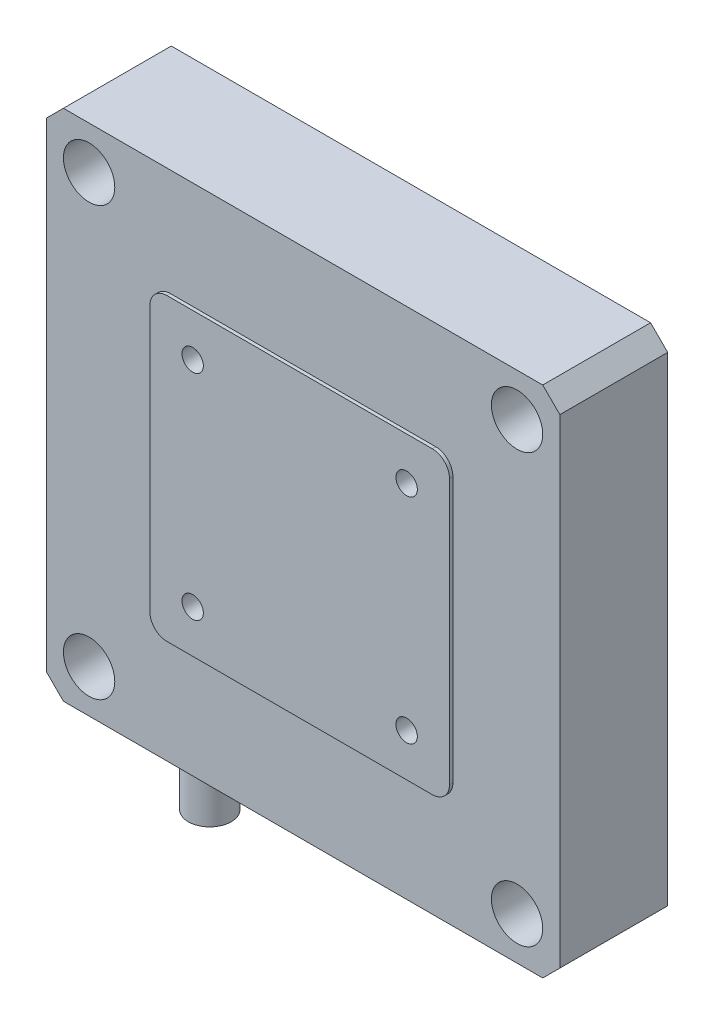
ISO-10303-21;
HEADER;
FILE_DESCRIPTION(('STEP AP214'),'2;1');
FILE_NAME('part.step','',(''),(''),'','','');
FILE_SCHEMA(('AUTOMOTIVE_DESIGN { 1 0 10303 214 1 1 1 1 }'));
ENDSEC;
DATA;
#1=APPLICATION_CONTEXT('core data for automotive mechanical design processes');
#2=APPLICATION_PROTOCOL_DEFINITION('international standard','automotive_design',2000,#1);
#3=PRODUCT_CONTEXT('',#1,'mechanical');
#4=PRODUCT('Part','Part','',(#3));
#5=PRODUCT_RELATED_PRODUCT_CATEGORY('part','',(#4));
#6=PRODUCT_DEFINITION_FORMATION('','',#4);
#7=PRODUCT_DEFINITION_CONTEXT('part definition',#1,'design');
#8=PRODUCT_DEFINITION('design','',#6,#7);
#9=PRODUCT_DEFINITION_SHAPE('','',#8);
#10=(LENGTH_UNIT() NAMED_UNIT(*) SI_UNIT(.MILLI.,.METRE.));
#11=(NAMED_UNIT(*) PLANE_ANGLE_UNIT() SI_UNIT($,.RADIAN.));
#12=(NAMED_UNIT(*) SI_UNIT($,.STERADIAN.) SOLID_ANGLE_UNIT());
#13=UNCERTAINTY_MEASURE_WITH_UNIT(LENGTH_MEASURE(1.E-05),#10,'distance_accuracy_value','');
#14=(GEOMETRIC_REPRESENTATION_CONTEXT(3) GLOBAL_UNCERTAINTY_ASSIGNED_CONTEXT((#13)) GLOBAL_UNIT_ASSIGNED_CONTEXT((#10,
#11,#12)) REPRESENTATION_CONTEXT('',''));
#15=CARTESIAN_POINT('',(0.,0.,0.));
#16=DIRECTION('',(0.,0.,1.));
#17=DIRECTION('',(1.,0.,0.));
#18=AXIS2_PLACEMENT_3D('',#15,#16,#17);
#19=CARTESIAN_POINT('',(30.,30.,12.6));
#20=DIRECTION('',(-1.,0.,0.));
#21=DIRECTION('',(0.,-1.,0.));
#22=AXIS2_PLACEMENT_3D('',#19,#20,#21);
#23=PLANE('',#22);
#24=DIRECTION('',(0.,1.,0.));
#25=VECTOR('',#24,1.);
#26=CARTESIAN_POINT('',(30.,30.,12.6));
#27=LINE('',#26,#25);
#28=CARTESIAN_POINT('',(30.,-28.,12.6));
#29=VERTEX_POINT('',#28);
#30=CARTESIAN_POINT('',(30.,28.,12.6));
#31=VERTEX_POINT('',#30);
#32=EDGE_CURVE('E305',#29,#31,#27,.T.);
#33=ORIENTED_EDGE('',*,*,#32,.F.);
#34=DIRECTION('',(0.,0.,-1.));
#35=VECTOR('',#34,1.);
#36=CARTESIAN_POINT('',(30.,-28.,12.6));
#37=LINE('',#36,#35);
#38=CARTESIAN_POINT('',(30.,-28.,0.));
#39=VERTEX_POINT('',#38);
#40=EDGE_CURVE('E377',#29,#39,#37,.T.);
#41=ORIENTED_EDGE('',*,*,#40,.T.);
#42=DIRECTION('',(0.,1.,0.));
#43=VECTOR('',#42,1.);
#44=CARTESIAN_POINT('',(30.,30.,0.));
#45=LINE('',#44,#43);
#46=CARTESIAN_POINT('',(30.,28.,0.));
#47=VERTEX_POINT('',#46);
#48=EDGE_CURVE('E291',#39,#47,#45,.T.);
#49=ORIENTED_EDGE('',*,*,#48,.T.);
#50=DIRECTION('',(0.,0.,1.));
#51=VECTOR('',#50,1.);
#52=CARTESIAN_POINT('',(30.,28.,12.6));
#53=LINE('',#52,#51);
#54=EDGE_CURVE('E374',#47,#31,#53,.T.);
#55=ORIENTED_EDGE('',*,*,#54,.T.);
#56=EDGE_LOOP('',(#33,#41,#49,#55));
#57=FACE_BOUND('',#56,.T.);
#58=ADVANCED_FACE('F41',(#57),#23,.F.);
#59=CARTESIAN_POINT('',(-30.,30.,12.6));
#60=DIRECTION('',(0.,-1.,0.));
#61=DIRECTION('',(0.,0.,-1.));
#62=AXIS2_PLACEMENT_3D('',#59,#60,#61);
#63=PLANE('',#62);
#64=DIRECTION('',(-1.,0.,0.));
#65=VECTOR('',#64,1.);
#66=CARTESIAN_POINT('',(-30.,30.,12.6));
#67=LINE('',#66,#65);
#68=CARTESIAN_POINT('',(28.,30.,12.6));
#69=VERTEX_POINT('',#68);
#70=CARTESIAN_POINT('',(-28.,30.,12.6));
#71=VERTEX_POINT('',#70);
#72=EDGE_CURVE('E309',#69,#71,#67,.T.);
#73=ORIENTED_EDGE('',*,*,#72,.F.);
#74=DIRECTION('',(0.,0.,-1.));
#75=VECTOR('',#74,1.);
#76=CARTESIAN_POINT('',(28.,30.,12.6));
#77=LINE('',#76,#75);
#78=CARTESIAN_POINT('',(28.,30.,0.));
#79=VERTEX_POINT('',#78);
#80=EDGE_CURVE('E384',#69,#79,#77,.T.);
#81=ORIENTED_EDGE('',*,*,#80,.T.);
#82=DIRECTION('',(-1.,0.,0.));
#83=VECTOR('',#82,1.);
#84=CARTESIAN_POINT('',(-30.,30.,0.));
#85=LINE('',#84,#83);
#86=CARTESIAN_POINT('',(-28.,30.,0.));
#87=VERTEX_POINT('',#86);
#88=EDGE_CURVE('E326',#79,#87,#85,.T.);
#89=ORIENTED_EDGE('',*,*,#88,.T.);
#90=DIRECTION('',(0.,0.,1.));
#91=VECTOR('',#90,1.);
#92=CARTESIAN_POINT('',(-28.,30.,12.6));
#93=LINE('',#92,#91);
#94=EDGE_CURVE('E381',#87,#71,#93,.T.);
#95=ORIENTED_EDGE('',*,*,#94,.T.);
#96=EDGE_LOOP('',(#73,#81,#89,#95));
#97=FACE_BOUND('',#96,.T.);
#98=ADVANCED_FACE('F480',(#97),#63,.F.);
#99=CARTESIAN_POINT('',(-30.,30.,12.6));
#100=DIRECTION('',(1.,0.,0.));
#101=DIRECTION('',(0.,1.,0.));
#102=AXIS2_PLACEMENT_3D('',#99,#100,#101);
#103=PLANE('',#102);
#104=DIRECTION('',(0.,-1.,0.));
#105=VECTOR('',#104,1.);
#106=CARTESIAN_POINT('',(-30.,30.,0.));
#107=LINE('',#106,#105);
#108=CARTESIAN_POINT('',(-30.,28.,0.));
#109=VERTEX_POINT('',#108);
#110=CARTESIAN_POINT('',(-30.,-28.,0.));
#111=VERTEX_POINT('',#110);
#112=EDGE_CURVE('E330',#109,#111,#107,.T.);
#113=ORIENTED_EDGE('',*,*,#112,.T.);
#114=DIRECTION('',(0.,0.,1.));
#115=VECTOR('',#114,1.);
#116=CARTESIAN_POINT('',(-30.,-28.,12.6));
#117=LINE('',#116,#115);
#118=CARTESIAN_POINT('',(-30.,-28.,12.6));
#119=VERTEX_POINT('',#118);
#120=EDGE_CURVE('E359',#111,#119,#117,.T.);
#121=ORIENTED_EDGE('',*,*,#120,.T.);
#122=DIRECTION('',(0.,-1.,0.));
#123=VECTOR('',#122,1.);
#124=CARTESIAN_POINT('',(-30.,30.,12.6));
#125=LINE('',#124,#123);
#126=CARTESIAN_POINT('',(-30.,28.,12.6));
#127=VERTEX_POINT('',#126);
#128=EDGE_CURVE('E314',#127,#119,#125,.T.);
#129=ORIENTED_EDGE('',*,*,#128,.F.);
#130=DIRECTION('',(0.,0.,-1.));
#131=VECTOR('',#130,1.);
#132=CARTESIAN_POINT('',(-30.,28.,12.6));
#133=LINE('',#132,#131);
#134=EDGE_CURVE('E355',#127,#109,#133,.T.);
#135=ORIENTED_EDGE('',*,*,#134,.T.);
#136=EDGE_LOOP('',(#113,#121,#129,#135));
#137=FACE_BOUND('',#136,.T.);
#138=ADVANCED_FACE('F486',(#137),#103,.F.);
#139=CARTESIAN_POINT('',(-30.,-30.,12.6));
#140=DIRECTION('',(0.,1.,0.));
#141=DIRECTION('',(0.,0.,1.));
#142=AXIS2_PLACEMENT_3D('',#139,#140,#141);
#143=PLANE('',#142);
#144=CARTESIAN_POINT('',(-18.5,-30.,5.));
#145=DIRECTION('',(0.,1.,0.));
#146=DIRECTION('',(0.,0.,1.));
#147=AXIS2_PLACEMENT_3D('',#144,#145,#146);
#148=CIRCLE('',#147,2.5);
#149=CARTESIAN_POINT('',(-18.5,-30.,7.5));
#150=VERTEX_POINT('',#149);
#151=EDGE_CURVE('E11',#150,#150,#148,.F.);
#152=ORIENTED_EDGE('',*,*,#151,.F.);
#153=EDGE_LOOP('',(#152));
#154=FACE_BOUND('',#153,.T.);
#155=DIRECTION('',(1.,0.,0.));
#156=VECTOR('',#155,1.);
#157=CARTESIAN_POINT('',(-30.,-30.,12.6));
#158=LINE('',#157,#156);
#159=CARTESIAN_POINT('',(-28.,-30.,12.6));
#160=VERTEX_POINT('',#159);
#161=CARTESIAN_POINT('',(28.,-30.,12.6));
#162=VERTEX_POINT('',#161);
#163=EDGE_CURVE('E318',#160,#162,#158,.T.);
#164=ORIENTED_EDGE('',*,*,#163,.F.);
#165=DIRECTION('',(0.,0.,-1.));
#166=VECTOR('',#165,1.);
#167=CARTESIAN_POINT('',(-28.,-30.,12.6));
#168=LINE('',#167,#166);
#169=CARTESIAN_POINT('',(-28.,-30.,0.));
#170=VERTEX_POINT('',#169);
#171=EDGE_CURVE('E339',#160,#170,#168,.T.);
#172=ORIENTED_EDGE('',*,*,#171,.T.);
#173=DIRECTION('',(1.,0.,0.));
#174=VECTOR('',#173,1.);
#175=CARTESIAN_POINT('',(-30.,-30.,0.));
#176=LINE('',#175,#174);
#177=CARTESIAN_POINT('',(28.,-30.,0.));
#178=VERTEX_POINT('',#177);
#179=EDGE_CURVE('E310',#170,#178,#176,.T.);
#180=ORIENTED_EDGE('',*,*,#179,.T.);
#181=DIRECTION('',(0.,0.,1.));
#182=VECTOR('',#181,1.);
#183=CARTESIAN_POINT('',(28.,-30.,12.6));
#184=LINE('',#183,#182);
#185=EDGE_CURVE('E322',#178,#162,#184,.T.);
#186=ORIENTED_EDGE('',*,*,#185,.T.);
#187=EDGE_LOOP('',(#164,#172,#180,#186));
#188=FACE_BOUND('',#187,.T.);
#189=ADVANCED_FACE('F524',(#154,#188),#143,.F.);
#190=CARTESIAN_POINT('',(0.,0.,12.6));
#191=DIRECTION('',(0.,0.,1.));
#192=DIRECTION('',(1.,0.,0.));
#193=AXIS2_PLACEMENT_3D('',#190,#191,#192);
#194=PLANE('',#193);
#195=CARTESIAN_POINT('',(-25.,25.,12.6));
#196=DIRECTION('',(0.,0.,1.));
#197=DIRECTION('',(1.,0.,0.));
#198=AXIS2_PLACEMENT_3D('',#195,#196,#197);
#199=CIRCLE('',#198,3.00000000000001);
#200=CARTESIAN_POINT('',(-22.,25.,12.6));
#201=VERTEX_POINT('',#200);
#202=EDGE_CURVE('E209',#201,#201,#199,.T.);
#203=ORIENTED_EDGE('',*,*,#202,.F.);
#204=EDGE_LOOP('',(#203));
#205=FACE_BOUND('',#204,.T.);
#206=CARTESIAN_POINT('',(25.,25.,12.6));
#207=DIRECTION('',(0.,0.,1.));
#208=DIRECTION('',(1.,0.,0.));
#209=AXIS2_PLACEMENT_3D('',#206,#207,#208);
#210=CIRCLE('',#209,3.00000000000001);
#211=CARTESIAN_POINT('',(28.,25.,12.6));
#212=VERTEX_POINT('',#211);
#213=EDGE_CURVE('E225',#212,#212,#210,.T.);
#214=ORIENTED_EDGE('',*,*,#213,.F.);
#215=EDGE_LOOP('',(#214));
#216=FACE_BOUND('',#215,.T.);
#217=CARTESIAN_POINT('',(-25.,-25.,12.6));
#218=DIRECTION('',(0.,0.,1.));
#219=DIRECTION('',(1.,0.,0.));
#220=AXIS2_PLACEMENT_3D('',#217,#218,#219);
#221=CIRCLE('',#220,3.00000000000001);
#222=CARTESIAN_POINT('',(-22.,-25.,12.6));
#223=VERTEX_POINT('',#222);
#224=EDGE_CURVE('E241',#223,#223,#221,.T.);
#225=ORIENTED_EDGE('',*,*,#224,.F.);
#226=EDGE_LOOP('',(#225));
#227=FACE_BOUND('',#226,.T.);
#228=CARTESIAN_POINT('',(25.,-25.,12.6));
#229=DIRECTION('',(0.,0.,1.));
#230=DIRECTION('',(1.,0.,0.));
#231=AXIS2_PLACEMENT_3D('',#228,#229,#230);
#232=CIRCLE('',#231,3.00000000000001);
#233=CARTESIAN_POINT('',(28.,-25.,12.6));
#234=VERTEX_POINT('',#233);
#235=EDGE_CURVE('E257',#234,#234,#232,.T.);
#236=ORIENTED_EDGE('',*,*,#235,.F.);
#237=EDGE_LOOP('',(#236));
#238=FACE_BOUND('',#237,.T.);
#239=DIRECTION('',(0.,1.,0.));
#240=VECTOR('',#239,1.);
#241=CARTESIAN_POINT('',(17.5,17.5,12.6));
#242=LINE('',#241,#240);
#243=CARTESIAN_POINT('',(17.5,-15.5,12.6));
#244=VERTEX_POINT('',#243);
#245=CARTESIAN_POINT('',(17.5,15.5,12.6));
#246=VERTEX_POINT('',#245);
#247=EDGE_CURVE('E273',#244,#246,#242,.T.);
#248=ORIENTED_EDGE('',*,*,#247,.F.);
#249=CARTESIAN_POINT('',(15.5,-15.5,12.6));
#250=DIRECTION('',(0.,0.,1.));
#251=DIRECTION('',(1.,0.,0.));
#252=AXIS2_PLACEMENT_3D('',#249,#250,#251);
#253=CIRCLE('',#252,2.);
#254=CARTESIAN_POINT('',(15.5,-17.5,12.6));
#255=VERTEX_POINT('',#254);
#256=EDGE_CURVE('E427',#244,#255,#253,.F.);
#257=ORIENTED_EDGE('',*,*,#256,.T.);
#258=DIRECTION('',(1.,0.,0.));
#259=VECTOR('',#258,1.);
#260=CARTESIAN_POINT('',(-17.5,-17.5,12.6));
#261=LINE('',#260,#259);
#262=CARTESIAN_POINT('',(-15.5,-17.5,12.6));
#263=VERTEX_POINT('',#262);
#264=EDGE_CURVE('E279',#263,#255,#261,.T.);
#265=ORIENTED_EDGE('',*,*,#264,.F.);
#266=CARTESIAN_POINT('',(-15.5,-15.5,12.6));
#267=DIRECTION('',(0.,0.,1.));
#268=DIRECTION('',(1.,0.,0.));
#269=AXIS2_PLACEMENT_3D('',#266,#267,#268);
#270=CIRCLE('',#269,2.);
#271=CARTESIAN_POINT('',(-17.5,-15.5,12.6));
#272=VERTEX_POINT('',#271);
#273=EDGE_CURVE('E430',#263,#272,#270,.F.);
#274=ORIENTED_EDGE('',*,*,#273,.T.);
#275=DIRECTION('',(0.,-1.,0.));
#276=VECTOR('',#275,1.);
#277=CARTESIAN_POINT('',(-17.5,17.5,12.6));
#278=LINE('',#277,#276);
#279=CARTESIAN_POINT('',(-17.5,15.5,12.6));
#280=VERTEX_POINT('',#279);
#281=EDGE_CURVE('E298',#280,#272,#278,.T.);
#282=ORIENTED_EDGE('',*,*,#281,.F.);
#283=CARTESIAN_POINT('',(-15.5,15.5,12.6));
#284=DIRECTION('',(0.,0.,1.));
#285=DIRECTION('',(1.,0.,0.));
#286=AXIS2_PLACEMENT_3D('',#283,#284,#285);
#287=CIRCLE('',#286,2.);
#288=CARTESIAN_POINT('',(-15.5,17.5,12.6));
#289=VERTEX_POINT('',#288);
#290=EDGE_CURVE('E50',#280,#289,#287,.F.);
#291=ORIENTED_EDGE('',*,*,#290,.T.);
#292=DIRECTION('',(-1.,0.,0.));
#293=VECTOR('',#292,1.);
#294=CARTESIAN_POINT('',(-17.5,17.5,12.6));
#295=LINE('',#294,#293);
#296=CARTESIAN_POINT('',(15.5,17.5,12.6));
#297=VERTEX_POINT('',#296);
#298=EDGE_CURVE('E295',#297,#289,#295,.T.);
#299=ORIENTED_EDGE('',*,*,#298,.F.);
#300=CARTESIAN_POINT('',(15.5,15.5,12.6));
#301=DIRECTION('',(0.,0.,1.));
#302=DIRECTION('',(1.,0.,0.));
#303=AXIS2_PLACEMENT_3D('',#300,#301,#302);
#304=CIRCLE('',#303,2.);
#305=EDGE_CURVE('E64',#297,#246,#304,.F.);
#306=ORIENTED_EDGE('',*,*,#305,.T.);
#307=EDGE_LOOP('',(#248,#257,#265,#274,#282,#291,#299,#306));
#308=FACE_BOUND('',#307,.T.);
#309=ORIENTED_EDGE('',*,*,#128,.T.);
#310=DIRECTION('',(-0.707106781186548,0.707106781186548,0.));
#311=VECTOR('',#310,1.);
#312=CARTESIAN_POINT('',(-29.,-29.,12.6));
#313=LINE('',#312,#311);
#314=EDGE_CURVE('E371',#119,#160,#313,.F.);
#315=ORIENTED_EDGE('',*,*,#314,.T.);
#316=ORIENTED_EDGE('',*,*,#163,.T.);
#317=DIRECTION('',(-0.707106781186548,-0.707106781186547,0.));
#318=VECTOR('',#317,1.);
#319=CARTESIAN_POINT('',(29.,-29.,12.6));
#320=LINE('',#319,#318);
#321=EDGE_CURVE('E368',#162,#29,#320,.F.);
#322=ORIENTED_EDGE('',*,*,#321,.T.);
#323=ORIENTED_EDGE('',*,*,#32,.T.);
#324=DIRECTION('',(0.707106781186548,-0.707106781186548,0.));
#325=VECTOR('',#324,1.);
#326=CARTESIAN_POINT('',(29.,29.,12.6));
#327=LINE('',#326,#325);
#328=EDGE_CURVE('E365',#31,#69,#327,.F.);
#329=ORIENTED_EDGE('',*,*,#328,.T.);
#330=ORIENTED_EDGE('',*,*,#72,.T.);
#331=DIRECTION('',(0.707106781186548,0.707106781186548,0.));
#332=VECTOR('',#331,1.);
#333=CARTESIAN_POINT('',(-29.,29.,12.6));
#334=LINE('',#333,#332);
#335=EDGE_CURVE('E362',#71,#127,#334,.F.);
#336=ORIENTED_EDGE('',*,*,#335,.T.);
#337=EDGE_LOOP('',(#309,#315,#316,#322,#323,#329,#330,#336));
#338=FACE_BOUND('',#337,.T.);
#339=ADVANCED_FACE('F436',(#205,#216,#227,#238,#308,#338),#194,.T.);
#340=CARTESIAN_POINT('',(0.,0.,0.));
#341=DIRECTION('',(0.,0.,1.));
#342=DIRECTION('',(1.,0.,0.));
#343=AXIS2_PLACEMENT_3D('',#340,#341,#342);
#344=PLANE('',#343);
#345=CARTESIAN_POINT('',(-25.,25.,0.));
#346=DIRECTION('',(0.,0.,1.));
#347=DIRECTION('',(1.,0.,0.));
#348=AXIS2_PLACEMENT_3D('',#345,#346,#347);
#349=CIRCLE('',#348,1.70000000000001);
#350=CARTESIAN_POINT('',(-23.3,25.,0.));
#351=VERTEX_POINT('',#350);
#352=EDGE_CURVE('E221',#351,#351,#349,.T.);
#353=ORIENTED_EDGE('',*,*,#352,.T.);
#354=EDGE_LOOP('',(#353));
#355=FACE_BOUND('',#354,.T.);
#356=CARTESIAN_POINT('',(25.,25.,0.));
#357=DIRECTION('',(0.,0.,1.));
#358=DIRECTION('',(1.,0.,0.));
#359=AXIS2_PLACEMENT_3D('',#356,#357,#358);
#360=CIRCLE('',#359,1.70000000000001);
#361=CARTESIAN_POINT('',(26.7,25.,0.));
#362=VERTEX_POINT('',#361);
#363=EDGE_CURVE('E237',#362,#362,#360,.T.);
#364=ORIENTED_EDGE('',*,*,#363,.T.);
#365=EDGE_LOOP('',(#364));
#366=FACE_BOUND('',#365,.T.);
#367=CARTESIAN_POINT('',(-25.,-25.,0.));
#368=DIRECTION('',(0.,0.,1.));
#369=DIRECTION('',(1.,0.,0.));
#370=AXIS2_PLACEMENT_3D('',#367,#368,#369);
#371=CIRCLE('',#370,1.70000000000001);
#372=CARTESIAN_POINT('',(-23.3,-25.,0.));
#373=VERTEX_POINT('',#372);
#374=EDGE_CURVE('E253',#373,#373,#371,.T.);
#375=ORIENTED_EDGE('',*,*,#374,.T.);
#376=EDGE_LOOP('',(#375));
#377=FACE_BOUND('',#376,.T.);
#378=CARTESIAN_POINT('',(25.,-25.,0.));
#379=DIRECTION('',(0.,0.,1.));
#380=DIRECTION('',(1.,0.,0.));
#381=AXIS2_PLACEMENT_3D('',#378,#379,#380);
#382=CIRCLE('',#381,1.70000000000001);
#383=CARTESIAN_POINT('',(26.7,-25.,0.));
#384=VERTEX_POINT('',#383);
#385=EDGE_CURVE('E269',#384,#384,#382,.T.);
#386=ORIENTED_EDGE('',*,*,#385,.T.);
#387=EDGE_LOOP('',(#386));
#388=FACE_BOUND('',#387,.T.);
#389=ORIENTED_EDGE('',*,*,#179,.F.);
#390=DIRECTION('',(0.707106781186548,-0.707106781186548,0.));
#391=VECTOR('',#390,1.);
#392=CARTESIAN_POINT('',(-28.,-30.,0.));
#393=LINE('',#392,#391);
#394=EDGE_CURVE('E352',#170,#111,#393,.F.);
#395=ORIENTED_EDGE('',*,*,#394,.T.);
#396=ORIENTED_EDGE('',*,*,#112,.F.);
#397=DIRECTION('',(-0.707106781186548,-0.707106781186548,0.));
#398=VECTOR('',#397,1.);
#399=CARTESIAN_POINT('',(-30.,28.,0.));
#400=LINE('',#399,#398);
#401=EDGE_CURVE('E343',#109,#87,#400,.F.);
#402=ORIENTED_EDGE('',*,*,#401,.T.);
#403=ORIENTED_EDGE('',*,*,#88,.F.);
#404=DIRECTION('',(-0.707106781186548,0.707106781186548,0.));
#405=VECTOR('',#404,1.);
#406=CARTESIAN_POINT('',(28.,30.,0.));
#407=LINE('',#406,#405);
#408=EDGE_CURVE('E346',#79,#47,#407,.F.);
#409=ORIENTED_EDGE('',*,*,#408,.T.);
#410=ORIENTED_EDGE('',*,*,#48,.F.);
#411=DIRECTION('',(0.707106781186548,0.707106781186547,0.));
#412=VECTOR('',#411,1.);
#413=CARTESIAN_POINT('',(30.,-28.,0.));
#414=LINE('',#413,#412);
#415=EDGE_CURVE('E349',#39,#178,#414,.F.);
#416=ORIENTED_EDGE('',*,*,#415,.T.);
#417=EDGE_LOOP('',(#389,#395,#396,#402,#403,#409,#410,#416));
#418=FACE_BOUND('',#417,.T.);
#419=ADVANCED_FACE('F496',(#355,#366,#377,#388,#418),#344,.F.);
#420=CARTESIAN_POINT('',(-28.,-30.,12.6));
#421=DIRECTION('',(0.707106781186547,0.707106781186547,0.));
#422=DIRECTION('',(0.,0.,-1.));
#423=AXIS2_PLACEMENT_3D('',#420,#421,#422);
#424=PLANE('',#423);
#425=ORIENTED_EDGE('',*,*,#314,.F.);
#426=ORIENTED_EDGE('',*,*,#120,.F.);
#427=ORIENTED_EDGE('',*,*,#394,.F.);
#428=ORIENTED_EDGE('',*,*,#171,.F.);
#429=EDGE_LOOP('',(#425,#426,#427,#428));
#430=FACE_BOUND('',#429,.T.);
#431=ADVANCED_FACE('F492',(#430),#424,.F.);
#432=CARTESIAN_POINT('',(30.,-28.,12.6));
#433=DIRECTION('',(-0.707106781186547,0.707106781186548,0.));
#434=DIRECTION('',(0.,0.,-1.));
#435=AXIS2_PLACEMENT_3D('',#432,#433,#434);
#436=PLANE('',#435);
#437=ORIENTED_EDGE('',*,*,#321,.F.);
#438=ORIENTED_EDGE('',*,*,#185,.F.);
#439=ORIENTED_EDGE('',*,*,#415,.F.);
#440=ORIENTED_EDGE('',*,*,#40,.F.);
#441=EDGE_LOOP('',(#437,#438,#439,#440));
#442=FACE_BOUND('',#441,.T.);
#443=ADVANCED_FACE('F495',(#442),#436,.F.);
#444=CARTESIAN_POINT('',(28.,30.,12.6));
#445=DIRECTION('',(-0.707106781186547,-0.707106781186547,0.));
#446=DIRECTION('',(0.,0.,-1.));
#447=AXIS2_PLACEMENT_3D('',#444,#445,#446);
#448=PLANE('',#447);
#449=ORIENTED_EDGE('',*,*,#328,.F.);
#450=ORIENTED_EDGE('',*,*,#54,.F.);
#451=ORIENTED_EDGE('',*,*,#408,.F.);
#452=ORIENTED_EDGE('',*,*,#80,.F.);
#453=EDGE_LOOP('',(#449,#450,#451,#452));
#454=FACE_BOUND('',#453,.T.);
#455=ADVANCED_FACE('F500',(#454),#448,.F.);
#456=CARTESIAN_POINT('',(-30.,28.,12.6));
#457=DIRECTION('',(0.707106781186547,-0.707106781186547,0.));
#458=DIRECTION('',(0.,0.,-1.));
#459=AXIS2_PLACEMENT_3D('',#456,#457,#458);
#460=PLANE('',#459);
#461=ORIENTED_EDGE('',*,*,#335,.F.);
#462=ORIENTED_EDGE('',*,*,#94,.F.);
#463=ORIENTED_EDGE('',*,*,#401,.F.);
#464=ORIENTED_EDGE('',*,*,#134,.F.);
#465=EDGE_LOOP('',(#461,#462,#463,#464));
#466=FACE_BOUND('',#465,.T.);
#467=ADVANCED_FACE('F503',(#466),#460,.F.);
#468=CARTESIAN_POINT('',(17.5,17.5,13.));
#469=DIRECTION('',(-1.,0.,0.));
#470=DIRECTION('',(0.,-1.,0.));
#471=AXIS2_PLACEMENT_3D('',#468,#469,#470);
#472=PLANE('',#471);
#473=DIRECTION('',(0.,1.,0.));
#474=VECTOR('',#473,1.);
#475=CARTESIAN_POINT('',(17.5,17.5,13.));
#476=LINE('',#475,#474);
#477=CARTESIAN_POINT('',(17.5,-15.5,13.));
#478=VERTEX_POINT('',#477);
#479=CARTESIAN_POINT('',(17.5,15.5,13.));
#480=VERTEX_POINT('',#479);
#481=EDGE_CURVE('E274',#478,#480,#476,.T.);
#482=ORIENTED_EDGE('',*,*,#481,.F.);
#483=DIRECTION('',(0.,0.,-1.));
#484=VECTOR('',#483,1.);
#485=CARTESIAN_POINT('',(17.5,-15.5,13.));
#486=LINE('',#485,#484);
#487=EDGE_CURVE('E391',#478,#244,#486,.T.);
#488=ORIENTED_EDGE('',*,*,#487,.T.);
#489=ORIENTED_EDGE('',*,*,#247,.T.);
#490=DIRECTION('',(0.,0.,-1.));
#491=VECTOR('',#490,1.);
#492=CARTESIAN_POINT('',(17.5,15.5,13.));
#493=LINE('',#492,#491);
#494=EDGE_CURVE('E388',#246,#480,#493,.F.);
#495=ORIENTED_EDGE('',*,*,#494,.T.);
#496=EDGE_LOOP('',(#482,#488,#489,#495));
#497=FACE_BOUND('',#496,.T.);
#498=ADVANCED_FACE('F440',(#497),#472,.F.);
#499=CARTESIAN_POINT('',(-17.5,17.5,13.));
#500=DIRECTION('',(0.,-1.,0.));
#501=DIRECTION('',(0.,0.,-1.));
#502=AXIS2_PLACEMENT_3D('',#499,#500,#501);
#503=PLANE('',#502);
#504=DIRECTION('',(-1.,0.,0.));
#505=VECTOR('',#504,1.);
#506=CARTESIAN_POINT('',(-17.5,17.5,13.));
#507=LINE('',#506,#505);
#508=CARTESIAN_POINT('',(15.5,17.5,13.));
#509=VERTEX_POINT('',#508);
#510=CARTESIAN_POINT('',(-15.5,17.5,13.));
#511=VERTEX_POINT('',#510);
#512=EDGE_CURVE('E278',#509,#511,#507,.T.);
#513=ORIENTED_EDGE('',*,*,#512,.F.);
#514=DIRECTION('',(0.,0.,-1.));
#515=VECTOR('',#514,1.);
#516=CARTESIAN_POINT('',(15.5,17.5,13.));
#517=LINE('',#516,#515);
#518=EDGE_CURVE('E424',#509,#297,#517,.T.);
#519=ORIENTED_EDGE('',*,*,#518,.T.);
#520=ORIENTED_EDGE('',*,*,#298,.T.);
#521=DIRECTION('',(0.,0.,-1.));
#522=VECTOR('',#521,1.);
#523=CARTESIAN_POINT('',(-15.5,17.5,13.));
#524=LINE('',#523,#522);
#525=EDGE_CURVE('E421',#289,#511,#524,.F.);
#526=ORIENTED_EDGE('',*,*,#525,.T.);
#527=EDGE_LOOP('',(#513,#519,#520,#526));
#528=FACE_BOUND('',#527,.T.);
#529=ADVANCED_FACE('F449',(#528),#503,.F.);
#530=CARTESIAN_POINT('',(-17.5,17.5,13.));
#531=DIRECTION('',(1.,0.,0.));
#532=DIRECTION('',(0.,1.,0.));
#533=AXIS2_PLACEMENT_3D('',#530,#531,#532);
#534=PLANE('',#533);
#535=ORIENTED_EDGE('',*,*,#281,.T.);
#536=DIRECTION('',(0.,0.,-1.));
#537=VECTOR('',#536,1.);
#538=CARTESIAN_POINT('',(-17.5,-15.5,13.));
#539=LINE('',#538,#537);
#540=CARTESIAN_POINT('',(-17.5,-15.5,13.));
#541=VERTEX_POINT('',#540);
#542=EDGE_CURVE('E418',#272,#541,#539,.F.);
#543=ORIENTED_EDGE('',*,*,#542,.T.);
#544=DIRECTION('',(0.,-1.,0.));
#545=VECTOR('',#544,1.);
#546=CARTESIAN_POINT('',(-17.5,17.5,13.));
#547=LINE('',#546,#545);
#548=CARTESIAN_POINT('',(-17.5,15.5,13.));
#549=VERTEX_POINT('',#548);
#550=EDGE_CURVE('E283',#549,#541,#547,.T.);
#551=ORIENTED_EDGE('',*,*,#550,.F.);
#552=DIRECTION('',(0.,0.,-1.));
#553=VECTOR('',#552,1.);
#554=CARTESIAN_POINT('',(-17.5,15.5,13.));
#555=LINE('',#554,#553);
#556=EDGE_CURVE('E414',#549,#280,#555,.T.);
#557=ORIENTED_EDGE('',*,*,#556,.T.);
#558=EDGE_LOOP('',(#535,#543,#551,#557));
#559=FACE_BOUND('',#558,.T.);
#560=ADVANCED_FACE('F456',(#559),#534,.F.);
#561=CARTESIAN_POINT('',(-17.5,-17.5,13.));
#562=DIRECTION('',(0.,1.,0.));
#563=DIRECTION('',(0.,0.,1.));
#564=AXIS2_PLACEMENT_3D('',#561,#562,#563);
#565=PLANE('',#564);
#566=ORIENTED_EDGE('',*,*,#264,.T.);
#567=DIRECTION('',(0.,0.,-1.));
#568=VECTOR('',#567,1.);
#569=CARTESIAN_POINT('',(15.5,-17.5,13.));
#570=LINE('',#569,#568);
#571=CARTESIAN_POINT('',(15.5,-17.5,13.));
#572=VERTEX_POINT('',#571);
#573=EDGE_CURVE('E399',#255,#572,#570,.F.);
#574=ORIENTED_EDGE('',*,*,#573,.T.);
#575=DIRECTION('',(1.,0.,0.));
#576=VECTOR('',#575,1.);
#577=CARTESIAN_POINT('',(-17.5,-17.5,13.));
#578=LINE('',#577,#576);
#579=CARTESIAN_POINT('',(-15.5,-17.5,13.));
#580=VERTEX_POINT('',#579);
#581=EDGE_CURVE('E287',#580,#572,#578,.T.);
#582=ORIENTED_EDGE('',*,*,#581,.F.);
#583=DIRECTION('',(0.,0.,-1.));
#584=VECTOR('',#583,1.);
#585=CARTESIAN_POINT('',(-15.5,-17.5,13.));
#586=LINE('',#585,#584);
#587=EDGE_CURVE('E395',#580,#263,#586,.T.);
#588=ORIENTED_EDGE('',*,*,#587,.T.);
#589=EDGE_LOOP('',(#566,#574,#582,#588));
#590=FACE_BOUND('',#589,.T.);
#591=ADVANCED_FACE('F464',(#590),#565,.F.);
#592=CARTESIAN_POINT('',(0.,0.,13.));
#593=DIRECTION('',(0.,0.,1.));
#594=DIRECTION('',(1.,0.,0.));
#595=AXIS2_PLACEMENT_3D('',#592,#593,#594);
#596=PLANE('',#595);
#597=CARTESIAN_POINT('',(-12.5,12.5,13.));
#598=DIRECTION('',(0.,0.,1.));
#599=DIRECTION('',(1.,0.,0.));
#600=AXIS2_PLACEMENT_3D('',#597,#598,#599);
#601=CIRCLE('',#600,1.25);
#602=CARTESIAN_POINT('',(-11.25,12.5,13.));
#603=VERTEX_POINT('',#602);
#604=EDGE_CURVE('E178',#603,#603,#601,.T.);
#605=ORIENTED_EDGE('',*,*,#604,.F.);
#606=EDGE_LOOP('',(#605));
#607=FACE_BOUND('',#606,.T.);
#608=CARTESIAN_POINT('',(12.5,12.5,13.));
#609=DIRECTION('',(0.,0.,1.));
#610=DIRECTION('',(1.,0.,0.));
#611=AXIS2_PLACEMENT_3D('',#608,#609,#610);
#612=CIRCLE('',#611,1.25);
#613=CARTESIAN_POINT('',(13.75,12.5,13.));
#614=VERTEX_POINT('',#613);
#615=EDGE_CURVE('E177',#614,#614,#612,.T.);
#616=ORIENTED_EDGE('',*,*,#615,.F.);
#617=EDGE_LOOP('',(#616));
#618=FACE_BOUND('',#617,.T.);
#619=CARTESIAN_POINT('',(12.5,-12.5,13.));
#620=DIRECTION('',(0.,0.,1.));
#621=DIRECTION('',(1.,0.,0.));
#622=AXIS2_PLACEMENT_3D('',#619,#620,#621);
#623=CIRCLE('',#622,1.25);
#624=CARTESIAN_POINT('',(13.75,-12.5,13.));
#625=VERTEX_POINT('',#624);
#626=EDGE_CURVE('E193',#625,#625,#623,.T.);
#627=ORIENTED_EDGE('',*,*,#626,.F.);
#628=EDGE_LOOP('',(#627));
#629=FACE_BOUND('',#628,.T.);
#630=CARTESIAN_POINT('',(-12.5,-12.5,13.));
#631=DIRECTION('',(0.,0.,1.));
#632=DIRECTION('',(1.,0.,0.));
#633=AXIS2_PLACEMENT_3D('',#630,#631,#632);
#634=CIRCLE('',#633,1.25);
#635=CARTESIAN_POINT('',(-11.25,-12.5,13.));
#636=VERTEX_POINT('',#635);
#637=EDGE_CURVE('E201',#636,#636,#634,.T.);
#638=ORIENTED_EDGE('',*,*,#637,.F.);
#639=EDGE_LOOP('',(#638));
#640=FACE_BOUND('',#639,.T.);
#641=ORIENTED_EDGE('',*,*,#581,.T.);
#642=CARTESIAN_POINT('',(15.5,-15.5,13.));
#643=DIRECTION('',(0.,0.,1.));
#644=DIRECTION('',(1.,0.,0.));
#645=AXIS2_PLACEMENT_3D('',#642,#643,#644);
#646=CIRCLE('',#645,2.);
#647=EDGE_CURVE('E411',#572,#478,#646,.T.);
#648=ORIENTED_EDGE('',*,*,#647,.T.);
#649=ORIENTED_EDGE('',*,*,#481,.T.);
#650=CARTESIAN_POINT('',(15.5,15.5,13.));
#651=DIRECTION('',(0.,0.,1.));
#652=DIRECTION('',(1.,0.,0.));
#653=AXIS2_PLACEMENT_3D('',#650,#651,#652);
#654=CIRCLE('',#653,2.);
#655=EDGE_CURVE('E405',#480,#509,#654,.T.);
#656=ORIENTED_EDGE('',*,*,#655,.T.);
#657=ORIENTED_EDGE('',*,*,#512,.T.);
#658=CARTESIAN_POINT('',(-15.5,15.5,13.));
#659=DIRECTION('',(0.,0.,1.));
#660=DIRECTION('',(1.,0.,0.));
#661=AXIS2_PLACEMENT_3D('',#658,#659,#660);
#662=CIRCLE('',#661,2.);
#663=EDGE_CURVE('E402',#511,#549,#662,.T.);
#664=ORIENTED_EDGE('',*,*,#663,.T.);
#665=ORIENTED_EDGE('',*,*,#550,.T.);
#666=CARTESIAN_POINT('',(-15.5,-15.5,13.));
#667=DIRECTION('',(0.,0.,1.));
#668=DIRECTION('',(1.,0.,0.));
#669=AXIS2_PLACEMENT_3D('',#666,#667,#668);
#670=CIRCLE('',#669,2.);
#671=EDGE_CURVE('E408',#541,#580,#670,.T.);
#672=ORIENTED_EDGE('',*,*,#671,.T.);
#673=EDGE_LOOP('',(#641,#648,#649,#656,#657,#664,#665,#672));
#674=FACE_BOUND('',#673,.T.);
#675=ADVANCED_FACE('F446',(#607,#618,#629,#640,#674),#596,.T.);
#676=CARTESIAN_POINT('',(15.5,-15.5,13.));
#677=DIRECTION('',(0.,0.,-1.));
#678=DIRECTION('',(-1.,0.,0.));
#679=AXIS2_PLACEMENT_3D('',#676,#677,#678);
#680=CYLINDRICAL_SURFACE('',#679,2.);
#681=ORIENTED_EDGE('',*,*,#647,.F.);
#682=ORIENTED_EDGE('',*,*,#573,.F.);
#683=ORIENTED_EDGE('',*,*,#256,.F.);
#684=ORIENTED_EDGE('',*,*,#487,.F.);
#685=EDGE_LOOP('',(#681,#682,#683,#684));
#686=FACE_BOUND('',#685,.T.);
#687=ADVANCED_FACE('F468',(#686),#680,.T.);
#688=CARTESIAN_POINT('',(-15.5,-15.5,13.));
#689=DIRECTION('',(0.,0.,-1.));
#690=DIRECTION('',(-1.,0.,0.));
#691=AXIS2_PLACEMENT_3D('',#688,#689,#690);
#692=CYLINDRICAL_SURFACE('',#691,2.);
#693=ORIENTED_EDGE('',*,*,#671,.F.);
#694=ORIENTED_EDGE('',*,*,#542,.F.);
#695=ORIENTED_EDGE('',*,*,#273,.F.);
#696=ORIENTED_EDGE('',*,*,#587,.F.);
#697=EDGE_LOOP('',(#693,#694,#695,#696));
#698=FACE_BOUND('',#697,.T.);
#699=ADVANCED_FACE('F459',(#698),#692,.T.);
#700=CARTESIAN_POINT('',(15.5,15.5,13.));
#701=DIRECTION('',(0.,0.,-1.));
#702=DIRECTION('',(-1.,0.,0.));
#703=AXIS2_PLACEMENT_3D('',#700,#701,#702);
#704=CYLINDRICAL_SURFACE('',#703,2.);
#705=ORIENTED_EDGE('',*,*,#655,.F.);
#706=ORIENTED_EDGE('',*,*,#494,.F.);
#707=ORIENTED_EDGE('',*,*,#305,.F.);
#708=ORIENTED_EDGE('',*,*,#518,.F.);
#709=EDGE_LOOP('',(#705,#706,#707,#708));
#710=FACE_BOUND('',#709,.T.);
#711=ADVANCED_FACE('F443',(#710),#704,.T.);
#712=CARTESIAN_POINT('',(-15.5,15.5,13.));
#713=DIRECTION('',(0.,0.,-1.));
#714=DIRECTION('',(-1.,0.,0.));
#715=AXIS2_PLACEMENT_3D('',#712,#713,#714);
#716=CYLINDRICAL_SURFACE('',#715,2.);
#717=ORIENTED_EDGE('',*,*,#663,.F.);
#718=ORIENTED_EDGE('',*,*,#525,.F.);
#719=ORIENTED_EDGE('',*,*,#290,.F.);
#720=ORIENTED_EDGE('',*,*,#556,.F.);
#721=EDGE_LOOP('',(#717,#718,#719,#720));
#722=FACE_BOUND('',#721,.T.);
#723=ADVANCED_FACE('F43',(#722),#716,.T.);
#724=CARTESIAN_POINT('',(25.,-25.,12.6));
#725=DIRECTION('',(0.,0.,1.));
#726=DIRECTION('',(1.,0.,0.));
#727=AXIS2_PLACEMENT_3D('',#724,#725,#726);
#728=CYLINDRICAL_SURFACE('',#727,1.70000000000001);
#729=ORIENTED_EDGE('',*,*,#385,.F.);
#730=EDGE_LOOP('',(#729));
#731=FACE_BOUND('',#730,.T.);
#732=CARTESIAN_POINT('',(25.,-25.,7.6));
#733=DIRECTION('',(0.,0.,1.));
#734=DIRECTION('',(1.,0.,0.));
#735=AXIS2_PLACEMENT_3D('',#732,#733,#734);
#736=CIRCLE('',#735,1.70000000000001);
#737=CARTESIAN_POINT('',(26.7,-25.,7.6));
#738=VERTEX_POINT('',#737);
#739=EDGE_CURVE('E265',#738,#738,#736,.T.);
#740=ORIENTED_EDGE('',*,*,#739,.T.);
#741=EDGE_LOOP('',(#740));
#742=FACE_BOUND('',#741,.T.);
#743=ADVANCED_FACE('F579',(#731,#742),#728,.F.);
#744=CARTESIAN_POINT('',(26.7,-25.,7.6));
#745=DIRECTION('',(0.,0.,-1.));
#746=DIRECTION('',(-1.,0.,0.));
#747=AXIS2_PLACEMENT_3D('',#744,#745,#746);
#748=PLANE('',#747);
#749=ORIENTED_EDGE('',*,*,#739,.F.);
#750=EDGE_LOOP('',(#749));
#751=FACE_BOUND('',#750,.T.);
#752=CARTESIAN_POINT('',(25.,-25.,7.6));
#753=DIRECTION('',(0.,0.,1.));
#754=DIRECTION('',(1.,0.,0.));
#755=AXIS2_PLACEMENT_3D('',#752,#753,#754);
#756=CIRCLE('',#755,3.00000000000001);
#757=CARTESIAN_POINT('',(28.,-25.,7.6));
#758=VERTEX_POINT('',#757);
#759=EDGE_CURVE('E261',#758,#758,#756,.T.);
#760=ORIENTED_EDGE('',*,*,#759,.T.);
#761=EDGE_LOOP('',(#760));
#762=FACE_BOUND('',#761,.T.);
#763=ADVANCED_FACE('F584',(#751,#762),#748,.F.);
#764=CARTESIAN_POINT('',(25.,-25.,12.6));
#765=DIRECTION('',(0.,0.,1.));
#766=DIRECTION('',(1.,0.,0.));
#767=AXIS2_PLACEMENT_3D('',#764,#765,#766);
#768=CYLINDRICAL_SURFACE('',#767,3.00000000000001);
#769=ORIENTED_EDGE('',*,*,#759,.F.);
#770=EDGE_LOOP('',(#769));
#771=FACE_BOUND('',#770,.T.);
#772=ORIENTED_EDGE('',*,*,#235,.T.);
#773=EDGE_LOOP('',(#772));
#774=FACE_BOUND('',#773,.T.);
#775=ADVANCED_FACE('F594',(#771,#774),#768,.F.);
#776=CARTESIAN_POINT('',(-25.,-25.,12.6));
#777=DIRECTION('',(0.,0.,1.));
#778=DIRECTION('',(1.,0.,0.));
#779=AXIS2_PLACEMENT_3D('',#776,#777,#778);
#780=CYLINDRICAL_SURFACE('',#779,1.70000000000001);
#781=ORIENTED_EDGE('',*,*,#374,.F.);
#782=EDGE_LOOP('',(#781));
#783=FACE_BOUND('',#782,.T.);
#784=CARTESIAN_POINT('',(-25.,-25.,7.6));
#785=DIRECTION('',(0.,0.,1.));
#786=DIRECTION('',(1.,0.,0.));
#787=AXIS2_PLACEMENT_3D('',#784,#785,#786);
#788=CIRCLE('',#787,1.70000000000001);
#789=CARTESIAN_POINT('',(-23.3,-25.,7.6));
#790=VERTEX_POINT('',#789);
#791=EDGE_CURVE('E249',#790,#790,#788,.T.);
#792=ORIENTED_EDGE('',*,*,#791,.T.);
#793=EDGE_LOOP('',(#792));
#794=FACE_BOUND('',#793,.T.);
#795=ADVANCED_FACE('F604',(#783,#794),#780,.F.);
#796=CARTESIAN_POINT('',(-23.3,-25.,7.6));
#797=DIRECTION('',(0.,0.,-1.));
#798=DIRECTION('',(-1.,0.,0.));
#799=AXIS2_PLACEMENT_3D('',#796,#797,#798);
#800=PLANE('',#799);
#801=ORIENTED_EDGE('',*,*,#791,.F.);
#802=EDGE_LOOP('',(#801));
#803=FACE_BOUND('',#802,.T.);
#804=CARTESIAN_POINT('',(-25.,-25.,7.6));
#805=DIRECTION('',(0.,0.,1.));
#806=DIRECTION('',(1.,0.,0.));
#807=AXIS2_PLACEMENT_3D('',#804,#805,#806);
#808=CIRCLE('',#807,3.00000000000001);
#809=CARTESIAN_POINT('',(-22.,-25.,7.6));
#810=VERTEX_POINT('',#809);
#811=EDGE_CURVE('E245',#810,#810,#808,.T.);
#812=ORIENTED_EDGE('',*,*,#811,.T.);
#813=EDGE_LOOP('',(#812));
#814=FACE_BOUND('',#813,.T.);
#815=ADVANCED_FACE('F614',(#803,#814),#800,.F.);
#816=CARTESIAN_POINT('',(-25.,-25.,12.6));
#817=DIRECTION('',(0.,0.,1.));
#818=DIRECTION('',(1.,0.,0.));
#819=AXIS2_PLACEMENT_3D('',#816,#817,#818);
#820=CYLINDRICAL_SURFACE('',#819,3.00000000000001);
#821=ORIENTED_EDGE('',*,*,#811,.F.);
#822=EDGE_LOOP('',(#821));
#823=FACE_BOUND('',#822,.T.);
#824=ORIENTED_EDGE('',*,*,#224,.T.);
#825=EDGE_LOOP('',(#824));
#826=FACE_BOUND('',#825,.T.);
#827=ADVANCED_FACE('F624',(#823,#826),#820,.F.);
#828=CARTESIAN_POINT('',(25.,25.,12.6));
#829=DIRECTION('',(0.,0.,1.));
#830=DIRECTION('',(1.,0.,0.));
#831=AXIS2_PLACEMENT_3D('',#828,#829,#830);
#832=CYLINDRICAL_SURFACE('',#831,1.70000000000001);
#833=ORIENTED_EDGE('',*,*,#363,.F.);
#834=EDGE_LOOP('',(#833));
#835=FACE_BOUND('',#834,.T.);
#836=CARTESIAN_POINT('',(25.,25.,7.6));
#837=DIRECTION('',(0.,0.,1.));
#838=DIRECTION('',(1.,0.,0.));
#839=AXIS2_PLACEMENT_3D('',#836,#837,#838);
#840=CIRCLE('',#839,1.70000000000001);
#841=CARTESIAN_POINT('',(26.7,25.,7.6));
#842=VERTEX_POINT('',#841);
#843=EDGE_CURVE('E233',#842,#842,#840,.T.);
#844=ORIENTED_EDGE('',*,*,#843,.T.);
#845=EDGE_LOOP('',(#844));
#846=FACE_BOUND('',#845,.T.);
#847=ADVANCED_FACE('F634',(#835,#846),#832,.F.);
#848=CARTESIAN_POINT('',(26.7,25.,7.6));
#849=DIRECTION('',(0.,0.,-1.));
#850=DIRECTION('',(-1.,0.,0.));
#851=AXIS2_PLACEMENT_3D('',#848,#849,#850);
#852=PLANE('',#851);
#853=ORIENTED_EDGE('',*,*,#843,.F.);
#854=EDGE_LOOP('',(#853));
#855=FACE_BOUND('',#854,.T.);
#856=CARTESIAN_POINT('',(25.,25.,7.6));
#857=DIRECTION('',(0.,0.,1.));
#858=DIRECTION('',(1.,0.,0.));
#859=AXIS2_PLACEMENT_3D('',#856,#857,#858);
#860=CIRCLE('',#859,3.00000000000001);
#861=CARTESIAN_POINT('',(28.,25.,7.6));
#862=VERTEX_POINT('',#861);
#863=EDGE_CURVE('E229',#862,#862,#860,.T.);
#864=ORIENTED_EDGE('',*,*,#863,.T.);
#865=EDGE_LOOP('',(#864));
#866=FACE_BOUND('',#865,.T.);
#867=ADVANCED_FACE('F644',(#855,#866),#852,.F.);
#868=CARTESIAN_POINT('',(25.,25.,12.6));
#869=DIRECTION('',(0.,0.,1.));
#870=DIRECTION('',(1.,0.,0.));
#871=AXIS2_PLACEMENT_3D('',#868,#869,#870);
#872=CYLINDRICAL_SURFACE('',#871,3.00000000000001);
#873=ORIENTED_EDGE('',*,*,#863,.F.);
#874=EDGE_LOOP('',(#873));
#875=FACE_BOUND('',#874,.T.);
#876=ORIENTED_EDGE('',*,*,#213,.T.);
#877=EDGE_LOOP('',(#876));
#878=FACE_BOUND('',#877,.T.);
#879=ADVANCED_FACE('F654',(#875,#878),#872,.F.);
#880=CARTESIAN_POINT('',(-25.,25.,12.6));
#881=DIRECTION('',(0.,0.,1.));
#882=DIRECTION('',(1.,0.,0.));
#883=AXIS2_PLACEMENT_3D('',#880,#881,#882);
#884=CYLINDRICAL_SURFACE('',#883,1.70000000000001);
#885=ORIENTED_EDGE('',*,*,#352,.F.);
#886=EDGE_LOOP('',(#885));
#887=FACE_BOUND('',#886,.T.);
#888=CARTESIAN_POINT('',(-25.,25.,7.6));
#889=DIRECTION('',(0.,0.,1.));
#890=DIRECTION('',(1.,0.,0.));
#891=AXIS2_PLACEMENT_3D('',#888,#889,#890);
#892=CIRCLE('',#891,1.70000000000001);
#893=CARTESIAN_POINT('',(-23.3,25.,7.6));
#894=VERTEX_POINT('',#893);
#895=EDGE_CURVE('E217',#894,#894,#892,.T.);
#896=ORIENTED_EDGE('',*,*,#895,.T.);
#897=EDGE_LOOP('',(#896));
#898=FACE_BOUND('',#897,.T.);
#899=ADVANCED_FACE('F664',(#887,#898),#884,.F.);
#900=CARTESIAN_POINT('',(-23.3,25.,7.6));
#901=DIRECTION('',(0.,0.,-1.));
#902=DIRECTION('',(-1.,0.,0.));
#903=AXIS2_PLACEMENT_3D('',#900,#901,#902);
#904=PLANE('',#903);
#905=ORIENTED_EDGE('',*,*,#895,.F.);
#906=EDGE_LOOP('',(#905));
#907=FACE_BOUND('',#906,.T.);
#908=CARTESIAN_POINT('',(-25.,25.,7.6));
#909=DIRECTION('',(0.,0.,1.));
#910=DIRECTION('',(1.,0.,0.));
#911=AXIS2_PLACEMENT_3D('',#908,#909,#910);
#912=CIRCLE('',#911,3.00000000000001);
#913=CARTESIAN_POINT('',(-22.,25.,7.6));
#914=VERTEX_POINT('',#913);
#915=EDGE_CURVE('E213',#914,#914,#912,.T.);
#916=ORIENTED_EDGE('',*,*,#915,.T.);
#917=EDGE_LOOP('',(#916));
#918=FACE_BOUND('',#917,.T.);
#919=ADVANCED_FACE('F674',(#907,#918),#904,.F.);
#920=CARTESIAN_POINT('',(-25.,25.,12.6));
#921=DIRECTION('',(0.,0.,1.));
#922=DIRECTION('',(1.,0.,0.));
#923=AXIS2_PLACEMENT_3D('',#920,#921,#922);
#924=CYLINDRICAL_SURFACE('',#923,3.00000000000001);
#925=ORIENTED_EDGE('',*,*,#915,.F.);
#926=EDGE_LOOP('',(#925));
#927=FACE_BOUND('',#926,.T.);
#928=ORIENTED_EDGE('',*,*,#202,.T.);
#929=EDGE_LOOP('',(#928));
#930=FACE_BOUND('',#929,.T.);
#931=ADVANCED_FACE('F684',(#927,#930),#924,.F.);
#932=CARTESIAN_POINT('',(-12.5,-12.5,9.5));
#933=DIRECTION('',(0.,0.,1.));
#934=DIRECTION('',(1.,0.,0.));
#935=AXIS2_PLACEMENT_3D('',#932,#933,#934);
#936=CONICAL_SURFACE('',#935,1.25,1.02974425867665);
#937=CARTESIAN_POINT('',(-12.5,-12.5,8.74892422621555));
#938=VERTEX_POINT('',#937);
#939=VERTEX_LOOP('',#938);
#940=FACE_BOUND('',#939,.T.);
#941=CARTESIAN_POINT('',(-12.5,-12.5,9.5));
#942=DIRECTION('',(0.,0.,1.));
#943=DIRECTION('',(1.,0.,0.));
#944=AXIS2_PLACEMENT_3D('',#941,#942,#943);
#945=CIRCLE('',#944,1.25);
#946=CARTESIAN_POINT('',(-11.25,-12.5,9.5));
#947=VERTEX_POINT('',#946);
#948=EDGE_CURVE('E205',#947,#947,#945,.T.);
#949=ORIENTED_EDGE('',*,*,#948,.T.);
#950=EDGE_LOOP('',(#949));
#951=FACE_BOUND('',#950,.T.);
#952=ADVANCED_FACE('F694',(#940,#951),#936,.F.);
#953=CARTESIAN_POINT('',(-12.5,-12.5,13.));
#954=DIRECTION('',(0.,0.,1.));
#955=DIRECTION('',(1.,0.,0.));
#956=AXIS2_PLACEMENT_3D('',#953,#954,#955);
#957=CYLINDRICAL_SURFACE('',#956,1.25);
#958=ORIENTED_EDGE('',*,*,#948,.F.);
#959=EDGE_LOOP('',(#958));
#960=FACE_BOUND('',#959,.T.);
#961=ORIENTED_EDGE('',*,*,#637,.T.);
#962=EDGE_LOOP('',(#961));
#963=FACE_BOUND('',#962,.T.);
#964=ADVANCED_FACE('F713',(#960,#963),#957,.F.);
#965=CARTESIAN_POINT('',(12.5,-12.5,9.5));
#966=DIRECTION('',(0.,0.,1.));
#967=DIRECTION('',(1.,0.,0.));
#968=AXIS2_PLACEMENT_3D('',#965,#966,#967);
#969=CONICAL_SURFACE('',#968,1.25,1.02974425867665);
#970=CARTESIAN_POINT('',(12.5,-12.5,8.74892422621555));
#971=VERTEX_POINT('',#970);
#972=VERTEX_LOOP('',#971);
#973=FACE_BOUND('',#972,.T.);
#974=CARTESIAN_POINT('',(12.5,-12.5,9.5));
#975=DIRECTION('',(0.,0.,1.));
#976=DIRECTION('',(1.,0.,0.));
#977=AXIS2_PLACEMENT_3D('',#974,#975,#976);
#978=CIRCLE('',#977,1.25);
#979=CARTESIAN_POINT('',(13.75,-12.5,9.5));
#980=VERTEX_POINT('',#979);
#981=EDGE_CURVE('E197',#980,#980,#978,.T.);
#982=ORIENTED_EDGE('',*,*,#981,.T.);
#983=EDGE_LOOP('',(#982));
#984=FACE_BOUND('',#983,.T.);
#985=ADVANCED_FACE('F724',(#973,#984),#969,.F.);
#986=CARTESIAN_POINT('',(12.5,-12.5,13.));
#987=DIRECTION('',(0.,0.,1.));
#988=DIRECTION('',(1.,0.,0.));
#989=AXIS2_PLACEMENT_3D('',#986,#987,#988);
#990=CYLINDRICAL_SURFACE('',#989,1.25);
#991=ORIENTED_EDGE('',*,*,#981,.F.);
#992=EDGE_LOOP('',(#991));
#993=FACE_BOUND('',#992,.T.);
#994=ORIENTED_EDGE('',*,*,#626,.T.);
#995=EDGE_LOOP('',(#994));
#996=FACE_BOUND('',#995,.T.);
#997=ADVANCED_FACE('F735',(#993,#996),#990,.F.);
#998=CARTESIAN_POINT('',(12.5,12.5,9.5));
#999=DIRECTION('',(0.,0.,1.));
#1000=DIRECTION('',(1.,0.,0.));
#1001=AXIS2_PLACEMENT_3D('',#998,#999,#1000);
#1002=CONICAL_SURFACE('',#1001,1.25,1.02974425867665);
#1003=CARTESIAN_POINT('',(12.5,12.5,8.74892422621555));
#1004=VERTEX_POINT('',#1003);
#1005=VERTEX_LOOP('',#1004);
#1006=FACE_BOUND('',#1005,.T.);
#1007=CARTESIAN_POINT('',(12.5,12.5,9.5));
#1008=DIRECTION('',(0.,0.,1.));
#1009=DIRECTION('',(1.,0.,0.));
#1010=AXIS2_PLACEMENT_3D('',#1007,#1008,#1009);
#1011=CIRCLE('',#1010,1.25);
#1012=CARTESIAN_POINT('',(13.75,12.5,9.5));
#1013=VERTEX_POINT('',#1012);
#1014=EDGE_CURVE('E183',#1013,#1013,#1011,.T.);
#1015=ORIENTED_EDGE('',*,*,#1014,.T.);
#1016=EDGE_LOOP('',(#1015));
#1017=FACE_BOUND('',#1016,.T.);
#1018=ADVANCED_FACE('F745',(#1006,#1017),#1002,.F.);
#1019=CARTESIAN_POINT('',(12.5,12.5,13.));
#1020=DIRECTION('',(0.,0.,1.));
#1021=DIRECTION('',(1.,0.,0.));
#1022=AXIS2_PLACEMENT_3D('',#1019,#1020,#1021);
#1023=CYLINDRICAL_SURFACE('',#1022,1.25);
#1024=ORIENTED_EDGE('',*,*,#1014,.F.);
#1025=EDGE_LOOP('',(#1024));
#1026=FACE_BOUND('',#1025,.T.);
#1027=ORIENTED_EDGE('',*,*,#615,.T.);
#1028=EDGE_LOOP('',(#1027));
#1029=FACE_BOUND('',#1028,.T.);
#1030=ADVANCED_FACE('F170',(#1026,#1029),#1023,.F.);
#1031=CARTESIAN_POINT('',(-12.5,12.5,9.5));
#1032=DIRECTION('',(0.,0.,1.));
#1033=DIRECTION('',(1.,0.,0.));
#1034=AXIS2_PLACEMENT_3D('',#1031,#1032,#1033);
#1035=CONICAL_SURFACE('',#1034,1.25,1.02974425867665);
#1036=CARTESIAN_POINT('',(-12.5,12.5,8.74892422621555));
#1037=VERTEX_POINT('',#1036);
#1038=VERTEX_LOOP('',#1037);
#1039=FACE_BOUND('',#1038,.T.);
#1040=CARTESIAN_POINT('',(-12.5,12.5,9.5));
#1041=DIRECTION('',(0.,0.,1.));
#1042=DIRECTION('',(1.,0.,0.));
#1043=AXIS2_PLACEMENT_3D('',#1040,#1041,#1042);
#1044=CIRCLE('',#1043,1.25);
#1045=CARTESIAN_POINT('',(-11.25,12.5,9.5));
#1046=VERTEX_POINT('',#1045);
#1047=EDGE_CURVE('E174',#1046,#1046,#1044,.T.);
#1048=ORIENTED_EDGE('',*,*,#1047,.T.);
#1049=EDGE_LOOP('',(#1048));
#1050=FACE_BOUND('',#1049,.T.);
#1051=ADVANCED_FACE('F166',(#1039,#1050),#1035,.F.);
#1052=CARTESIAN_POINT('',(-12.5,12.5,13.));
#1053=DIRECTION('',(0.,0.,1.));
#1054=DIRECTION('',(1.,0.,0.));
#1055=AXIS2_PLACEMENT_3D('',#1052,#1053,#1054);
#1056=CYLINDRICAL_SURFACE('',#1055,1.25);
#1057=ORIENTED_EDGE('',*,*,#1047,.F.);
#1058=EDGE_LOOP('',(#1057));
#1059=FACE_BOUND('',#1058,.T.);
#1060=ORIENTED_EDGE('',*,*,#604,.T.);
#1061=EDGE_LOOP('',(#1060));
#1062=FACE_BOUND('',#1061,.T.);
#1063=ADVANCED_FACE('F169',(#1059,#1062),#1056,.F.);
#1064=CARTESIAN_POINT('',(-18.5,-40.,5.));
#1065=DIRECTION('',(0.,1.,0.));
#1066=DIRECTION('',(0.,0.,1.));
#1067=AXIS2_PLACEMENT_3D('',#1064,#1065,#1066);
#1068=CYLINDRICAL_SURFACE('',#1067,2.5);
#1069=CARTESIAN_POINT('',(-18.5,-40.,5.));
#1070=DIRECTION('',(0.,-1.,0.));
#1071=DIRECTION('',(0.,0.,-1.));
#1072=AXIS2_PLACEMENT_3D('',#1069,#1070,#1071);
#1073=CIRCLE('',#1072,2.5);
#1074=CARTESIAN_POINT('',(-18.5,-40.,2.5));
#1075=VERTEX_POINT('',#1074);
#1076=EDGE_CURVE('E186',#1075,#1075,#1073,.T.);
#1077=ORIENTED_EDGE('',*,*,#1076,.F.);
#1078=EDGE_LOOP('',(#1077));
#1079=FACE_BOUND('',#1078,.T.);
#1080=ORIENTED_EDGE('',*,*,#151,.T.);
#1081=EDGE_LOOP('',(#1080));
#1082=FACE_BOUND('',#1081,.T.);
#1083=ADVANCED_FACE('F779',(#1079,#1082),#1068,.T.);
#1084=CARTESIAN_POINT('',(-18.5,-40.,5.));
#1085=DIRECTION('',(0.,-1.,0.));
#1086=DIRECTION('',(0.,0.,-1.));
#1087=AXIS2_PLACEMENT_3D('',#1084,#1085,#1086);
#1088=PLANE('',#1087);
#1089=ORIENTED_EDGE('',*,*,#1076,.T.);
#1090=EDGE_LOOP('',(#1089));
#1091=FACE_BOUND('',#1090,.T.);
#1092=ADVANCED_FACE('F789',(#1091),#1088,.T.);
#1093=CLOSED_SHELL('',(#58,#98,#138,#189,#339,#419,#431,#443,#455,#467,#498,#529,#560,#591,#675,
#687,#699,#711,#723,#743,#763,#775,#795,#815,#827,#847,#867,#879,#899,#919,#931,#952,#964,#985,
#997,#1018,#1030,#1051,#1063,#1083,#1092));
#1094=MANIFOLD_SOLID_BREP('B2',#1093);
#1095=ADVANCED_BREP_SHAPE_REPRESENTATION('',(#18,#1094),#14);
#1096=SHAPE_DEFINITION_REPRESENTATION(#9,#1095);
ENDSEC;
END-ISO-10303-21;
